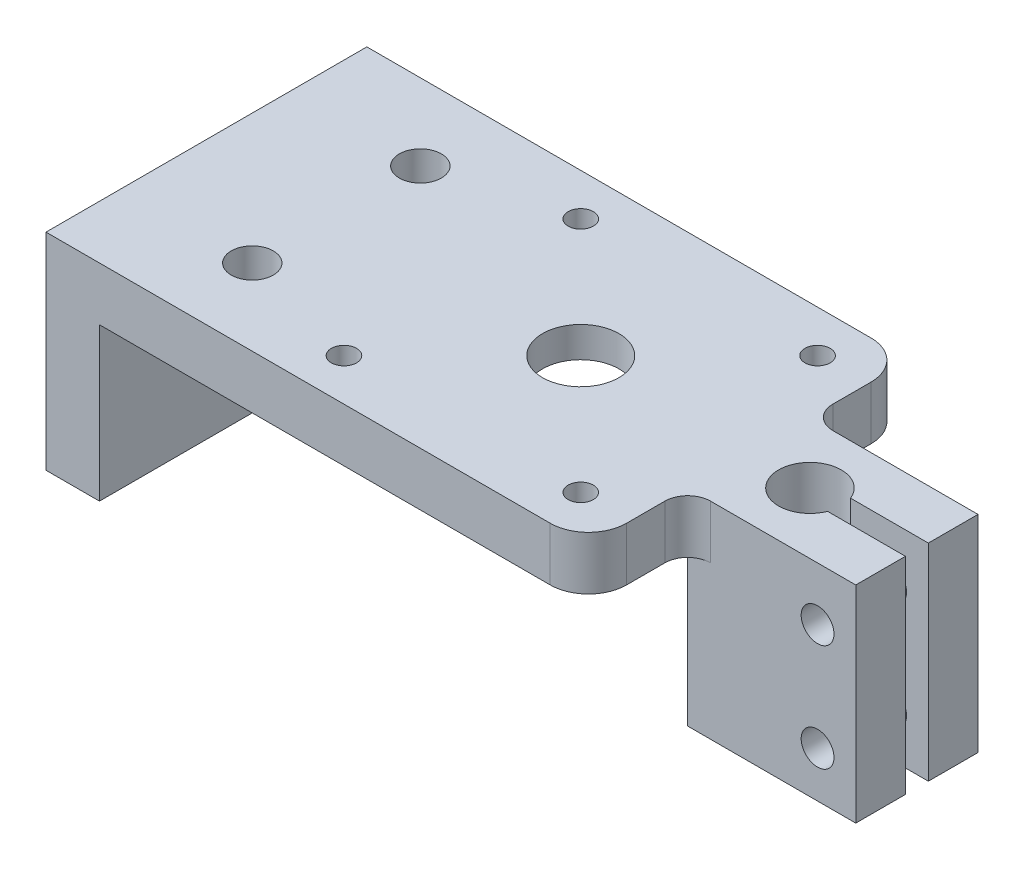
ISO-10303-21;
HEADER;
FILE_DESCRIPTION(('STEP AP214'),'2;1');
FILE_NAME('part.step','',(''),(''),'','','');
FILE_SCHEMA(('AUTOMOTIVE_DESIGN { 1 0 10303 214 1 1 1 1 }'));
ENDSEC;
DATA;
#1=APPLICATION_CONTEXT('core data for automotive mechanical design processes');
#2=APPLICATION_PROTOCOL_DEFINITION('international standard','automotive_design',2000,#1);
#3=PRODUCT_CONTEXT('',#1,'mechanical');
#4=PRODUCT('Part','Part','',(#3));
#5=PRODUCT_RELATED_PRODUCT_CATEGORY('part','',(#4));
#6=PRODUCT_DEFINITION_FORMATION('','',#4);
#7=PRODUCT_DEFINITION_CONTEXT('part definition',#1,'design');
#8=PRODUCT_DEFINITION('design','',#6,#7);
#9=PRODUCT_DEFINITION_SHAPE('','',#8);
#10=(LENGTH_UNIT() NAMED_UNIT(*) SI_UNIT(.MILLI.,.METRE.));
#11=(NAMED_UNIT(*) PLANE_ANGLE_UNIT() SI_UNIT($,.RADIAN.));
#12=(NAMED_UNIT(*) SI_UNIT($,.STERADIAN.) SOLID_ANGLE_UNIT());
#13=UNCERTAINTY_MEASURE_WITH_UNIT(LENGTH_MEASURE(1.E-05),#10,'distance_accuracy_value','');
#14=(GEOMETRIC_REPRESENTATION_CONTEXT(3) GLOBAL_UNCERTAINTY_ASSIGNED_CONTEXT((#13)) GLOBAL_UNIT_ASSIGNED_CONTEXT((#10,
#11,#12)) REPRESENTATION_CONTEXT('',''));
#15=CARTESIAN_POINT('',(0.,0.,0.));
#16=DIRECTION('',(0.,0.,1.));
#17=DIRECTION('',(1.,0.,0.));
#18=AXIS2_PLACEMENT_3D('',#15,#16,#17);
#19=CARTESIAN_POINT('',(54.,-20.,7.99999999999999));
#20=DIRECTION('',(1.,0.,0.));
#21=DIRECTION('',(0.,0.,-1.));
#22=AXIS2_PLACEMENT_3D('',#19,#20,#21);
#23=PLANE('',#22);
#24=DIRECTION('',(0.,1.,0.));
#25=VECTOR('',#24,1.);
#26=CARTESIAN_POINT('',(54.,-20.,1.49999999999999));
#27=LINE('',#26,#25);
#28=CARTESIAN_POINT('',(54.,-20.,1.49999999999999));
#29=VERTEX_POINT('',#28);
#30=CARTESIAN_POINT('',(54.,7.,1.49999999999999));
#31=VERTEX_POINT('',#30);
#32=EDGE_CURVE('E195',#29,#31,#27,.T.);
#33=ORIENTED_EDGE('',*,*,#32,.T.);
#34=DIRECTION('',(0.,0.,-1.));
#35=VECTOR('',#34,1.);
#36=CARTESIAN_POINT('',(54.,7.,7.99999999999999));
#37=LINE('',#36,#35);
#38=CARTESIAN_POINT('',(54.,7.,7.99999999999999));
#39=VERTEX_POINT('',#38);
#40=EDGE_CURVE('E346',#39,#31,#37,.T.);
#41=ORIENTED_EDGE('',*,*,#40,.F.);
#42=DIRECTION('',(0.,1.,0.));
#43=VECTOR('',#42,1.);
#44=CARTESIAN_POINT('',(54.,-20.,7.99999999999999));
#45=LINE('',#44,#43);
#46=CARTESIAN_POINT('',(54.,-20.,7.99999999999999));
#47=VERTEX_POINT('',#46);
#48=EDGE_CURVE('E215',#47,#39,#45,.T.);
#49=ORIENTED_EDGE('',*,*,#48,.F.);
#50=DIRECTION('',(0.,0.,-1.));
#51=VECTOR('',#50,1.);
#52=CARTESIAN_POINT('',(54.,-20.,7.99999999999999));
#53=LINE('',#52,#51);
#54=EDGE_CURVE('E202',#47,#29,#53,.T.);
#55=ORIENTED_EDGE('',*,*,#54,.T.);
#56=EDGE_LOOP('',(#33,#41,#49,#55));
#57=FACE_BOUND('',#56,.T.);
#58=ADVANCED_FACE('F39',(#57),#23,.T.);
#59=CARTESIAN_POINT('',(49.,-14.,14.0000000000001));
#60=DIRECTION('',(0.,0.,-1.));
#61=DIRECTION('',(-1.,0.,0.));
#62=AXIS2_PLACEMENT_3D('',#59,#60,#61);
#63=CYLINDRICAL_SURFACE('',#62,2.15);
#64=CARTESIAN_POINT('',(49.,-14.,1.5));
#65=DIRECTION('',(0.,0.,1.));
#66=DIRECTION('',(1.,0.,0.));
#67=AXIS2_PLACEMENT_3D('',#64,#65,#66);
#68=CIRCLE('',#67,2.15);
#69=CARTESIAN_POINT('',(51.15,-14.,1.5));
#70=VERTEX_POINT('',#69);
#71=EDGE_CURVE('E284',#70,#70,#68,.F.);
#72=ORIENTED_EDGE('',*,*,#71,.T.);
#73=EDGE_LOOP('',(#72));
#74=FACE_BOUND('',#73,.T.);
#75=CARTESIAN_POINT('',(49.,-14.,7.99999999999999));
#76=DIRECTION('',(0.,0.,1.));
#77=DIRECTION('',(1.,0.,0.));
#78=AXIS2_PLACEMENT_3D('',#75,#76,#77);
#79=CIRCLE('',#78,2.15);
#80=CARTESIAN_POINT('',(51.15,-14.,7.99999999999999));
#81=VERTEX_POINT('',#80);
#82=EDGE_CURVE('E435',#81,#81,#79,.T.);
#83=ORIENTED_EDGE('',*,*,#82,.T.);
#84=EDGE_LOOP('',(#83));
#85=FACE_BOUND('',#84,.T.);
#86=ADVANCED_FACE('F473',(#74,#85),#63,.F.);
#87=CARTESIAN_POINT('',(49.,0.,14.0000000000001));
#88=DIRECTION('',(0.,0.,-1.));
#89=DIRECTION('',(-1.,0.,0.));
#90=AXIS2_PLACEMENT_3D('',#87,#88,#89);
#91=CYLINDRICAL_SURFACE('',#90,2.15);
#92=CARTESIAN_POINT('',(49.,0.,1.5));
#93=DIRECTION('',(0.,0.,1.));
#94=DIRECTION('',(1.,0.,0.));
#95=AXIS2_PLACEMENT_3D('',#92,#93,#94);
#96=CIRCLE('',#95,2.15);
#97=CARTESIAN_POINT('',(51.15,0.,1.5));
#98=VERTEX_POINT('',#97);
#99=EDGE_CURVE('E281',#98,#98,#96,.F.);
#100=ORIENTED_EDGE('',*,*,#99,.T.);
#101=EDGE_LOOP('',(#100));
#102=FACE_BOUND('',#101,.T.);
#103=CARTESIAN_POINT('',(49.,0.,7.99999999999999));
#104=DIRECTION('',(0.,0.,1.));
#105=DIRECTION('',(1.,0.,0.));
#106=AXIS2_PLACEMENT_3D('',#103,#104,#105);
#107=CIRCLE('',#106,2.15);
#108=CARTESIAN_POINT('',(51.15,0.,7.99999999999999));
#109=VERTEX_POINT('',#108);
#110=EDGE_CURVE('E432',#109,#109,#107,.T.);
#111=ORIENTED_EDGE('',*,*,#110,.T.);
#112=EDGE_LOOP('',(#111));
#113=FACE_BOUND('',#112,.T.);
#114=ADVANCED_FACE('F470',(#102,#113),#91,.F.);
#115=CARTESIAN_POINT('',(32.,7.,21.));
#116=DIRECTION('',(-1.,0.,0.));
#117=DIRECTION('',(0.,0.,1.));
#118=AXIS2_PLACEMENT_3D('',#115,#116,#117);
#119=PLANE('',#118);
#120=DIRECTION('',(0.,0.,-1.));
#121=VECTOR('',#120,1.);
#122=CARTESIAN_POINT('',(32.,0.,21.));
#123=LINE('',#122,#121);
#124=CARTESIAN_POINT('',(32.,0.,-11.));
#125=VERTEX_POINT('',#124);
#126=CARTESIAN_POINT('',(32.,0.,-16.));
#127=VERTEX_POINT('',#126);
#128=EDGE_CURVE('E242',#125,#127,#123,.T.);
#129=ORIENTED_EDGE('',*,*,#128,.T.);
#130=DIRECTION('',(0.,-1.,0.));
#131=VECTOR('',#130,1.);
#132=CARTESIAN_POINT('',(32.,7.,-16.));
#133=LINE('',#132,#131);
#134=CARTESIAN_POINT('',(32.,7.,-16.));
#135=VERTEX_POINT('',#134);
#136=EDGE_CURVE('E316',#127,#135,#133,.F.);
#137=ORIENTED_EDGE('',*,*,#136,.T.);
#138=DIRECTION('',(0.,0.,-1.));
#139=VECTOR('',#138,1.);
#140=CARTESIAN_POINT('',(32.,7.,21.));
#141=LINE('',#140,#139);
#142=CARTESIAN_POINT('',(32.,7.,-11.));
#143=VERTEX_POINT('',#142);
#144=EDGE_CURVE('E230',#143,#135,#141,.T.);
#145=ORIENTED_EDGE('',*,*,#144,.F.);
#146=DIRECTION('',(0.,1.,0.));
#147=VECTOR('',#146,1.);
#148=CARTESIAN_POINT('',(32.,7.,-11.));
#149=LINE('',#148,#147);
#150=EDGE_CURVE('E298',#143,#125,#149,.F.);
#151=ORIENTED_EDGE('',*,*,#150,.T.);
#152=EDGE_LOOP('',(#129,#137,#145,#151));
#153=FACE_BOUND('',#152,.T.);
#154=ADVANCED_FACE('F365',(#153),#119,.F.);
#155=CARTESIAN_POINT('',(-32.,7.,21.));
#156=DIRECTION('',(0.,0.,-1.));
#157=DIRECTION('',(-1.,0.,0.));
#158=AXIS2_PLACEMENT_3D('',#155,#156,#157);
#159=PLANE('',#158);
#160=DIRECTION('',(1.,0.,0.));
#161=VECTOR('',#160,1.);
#162=CARTESIAN_POINT('',(-32.,0.,21.));
#163=LINE('',#162,#161);
#164=CARTESIAN_POINT('',(-32.,0.,21.));
#165=VERTEX_POINT('',#164);
#166=CARTESIAN_POINT('',(27.,0.,21.));
#167=VERTEX_POINT('',#166);
#168=EDGE_CURVE('E231',#165,#167,#163,.T.);
#169=ORIENTED_EDGE('',*,*,#168,.T.);
#170=DIRECTION('',(0.,-1.,0.));
#171=VECTOR('',#170,1.);
#172=CARTESIAN_POINT('',(27.,7.,21.));
#173=LINE('',#172,#171);
#174=CARTESIAN_POINT('',(27.,7.,21.));
#175=VERTEX_POINT('',#174);
#176=EDGE_CURVE('E11',#167,#175,#173,.F.);
#177=ORIENTED_EDGE('',*,*,#176,.T.);
#178=DIRECTION('',(1.,0.,0.));
#179=VECTOR('',#178,1.);
#180=CARTESIAN_POINT('',(-32.,7.,21.));
#181=LINE('',#180,#179);
#182=CARTESIAN_POINT('',(-39.,7.,21.));
#183=VERTEX_POINT('',#182);
#184=EDGE_CURVE('E234',#183,#175,#181,.T.);
#185=ORIENTED_EDGE('',*,*,#184,.F.);
#186=DIRECTION('',(0.,1.,0.));
#187=VECTOR('',#186,1.);
#188=CARTESIAN_POINT('',(-39.,7.,21.));
#189=LINE('',#188,#187);
#190=CARTESIAN_POINT('',(-39.,-20.,21.));
#191=VERTEX_POINT('',#190);
#192=EDGE_CURVE('E421',#191,#183,#189,.T.);
#193=ORIENTED_EDGE('',*,*,#192,.F.);
#194=DIRECTION('',(1.,0.,0.));
#195=VECTOR('',#194,1.);
#196=CARTESIAN_POINT('',(-39.,-20.,21.));
#197=LINE('',#196,#195);
#198=CARTESIAN_POINT('',(-32.,-20.,21.));
#199=VERTEX_POINT('',#198);
#200=EDGE_CURVE('E407',#191,#199,#197,.T.);
#201=ORIENTED_EDGE('',*,*,#200,.T.);
#202=DIRECTION('',(0.,1.,0.));
#203=VECTOR('',#202,1.);
#204=CARTESIAN_POINT('',(-32.,7.,21.));
#205=LINE('',#204,#203);
#206=EDGE_CURVE('E411',#199,#165,#205,.T.);
#207=ORIENTED_EDGE('',*,*,#206,.T.);
#208=EDGE_LOOP('',(#169,#177,#185,#193,#201,#207));
#209=FACE_BOUND('',#208,.T.);
#210=ADVANCED_FACE('F615',(#209),#159,.F.);
#211=CARTESIAN_POINT('',(32.,7.,16.));
#212=VERTEX_POINT('',#211);
#213=CARTESIAN_POINT('',(32.,7.,11.));
#214=VERTEX_POINT('',#213);
#215=EDGE_CURVE('E232',#212,#214,#141,.T.);
#216=ORIENTED_EDGE('',*,*,#215,.F.);
#217=DIRECTION('',(0.,-1.,0.));
#218=VECTOR('',#217,1.);
#219=CARTESIAN_POINT('',(32.,7.,16.));
#220=LINE('',#219,#218);
#221=CARTESIAN_POINT('',(32.,0.,16.));
#222=VERTEX_POINT('',#221);
#223=EDGE_CURVE('E47',#212,#222,#220,.T.);
#224=ORIENTED_EDGE('',*,*,#223,.T.);
#225=CARTESIAN_POINT('',(32.,0.,11.));
#226=VERTEX_POINT('',#225);
#227=EDGE_CURVE('E243',#222,#226,#123,.T.);
#228=ORIENTED_EDGE('',*,*,#227,.T.);
#229=DIRECTION('',(0.,1.,0.));
#230=VECTOR('',#229,1.);
#231=CARTESIAN_POINT('',(32.,7.,11.));
#232=LINE('',#231,#230);
#233=EDGE_CURVE('E236',#226,#214,#232,.T.);
#234=ORIENTED_EDGE('',*,*,#233,.T.);
#235=EDGE_LOOP('',(#216,#224,#228,#234));
#236=FACE_BOUND('',#235,.T.);
#237=ADVANCED_FACE('F324',(#236),#119,.F.);
#238=CARTESIAN_POINT('',(-32.,7.,-21.));
#239=DIRECTION('',(0.,0.,-1.));
#240=DIRECTION('',(-1.,0.,0.));
#241=AXIS2_PLACEMENT_3D('',#238,#239,#240);
#242=PLANE('',#241);
#243=DIRECTION('',(1.,0.,0.));
#244=VECTOR('',#243,1.);
#245=CARTESIAN_POINT('',(-32.,7.,-21.));
#246=LINE('',#245,#244);
#247=CARTESIAN_POINT('',(-39.,7.,-21.));
#248=VERTEX_POINT('',#247);
#249=CARTESIAN_POINT('',(27.,7.,-21.));
#250=VERTEX_POINT('',#249);
#251=EDGE_CURVE('E227',#248,#250,#246,.T.);
#252=ORIENTED_EDGE('',*,*,#251,.T.);
#253=DIRECTION('',(0.,-1.,0.));
#254=VECTOR('',#253,1.);
#255=CARTESIAN_POINT('',(27.,0.,-21.));
#256=LINE('',#255,#254);
#257=CARTESIAN_POINT('',(27.,0.,-21.));
#258=VERTEX_POINT('',#257);
#259=EDGE_CURVE('E309',#250,#258,#256,.T.);
#260=ORIENTED_EDGE('',*,*,#259,.T.);
#261=DIRECTION('',(1.,0.,0.));
#262=VECTOR('',#261,1.);
#263=CARTESIAN_POINT('',(-32.,0.,-21.));
#264=LINE('',#263,#262);
#265=CARTESIAN_POINT('',(-32.,0.,-21.));
#266=VERTEX_POINT('',#265);
#267=EDGE_CURVE('E239',#266,#258,#264,.T.);
#268=ORIENTED_EDGE('',*,*,#267,.F.);
#269=DIRECTION('',(0.,-1.,0.));
#270=VECTOR('',#269,1.);
#271=CARTESIAN_POINT('',(-32.,7.,-21.));
#272=LINE('',#271,#270);
#273=CARTESIAN_POINT('',(-32.,-20.,-21.));
#274=VERTEX_POINT('',#273);
#275=EDGE_CURVE('E417',#266,#274,#272,.T.);
#276=ORIENTED_EDGE('',*,*,#275,.T.);
#277=DIRECTION('',(1.,0.,0.));
#278=VECTOR('',#277,1.);
#279=CARTESIAN_POINT('',(-39.,-20.,-21.));
#280=LINE('',#279,#278);
#281=CARTESIAN_POINT('',(-39.,-20.,-21.));
#282=VERTEX_POINT('',#281);
#283=EDGE_CURVE('E400',#282,#274,#280,.T.);
#284=ORIENTED_EDGE('',*,*,#283,.F.);
#285=DIRECTION('',(0.,-1.,0.));
#286=VECTOR('',#285,1.);
#287=CARTESIAN_POINT('',(-39.,7.,-21.));
#288=LINE('',#287,#286);
#289=EDGE_CURVE('E414',#248,#282,#288,.T.);
#290=ORIENTED_EDGE('',*,*,#289,.F.);
#291=EDGE_LOOP('',(#252,#260,#268,#276,#284,#290));
#292=FACE_BOUND('',#291,.T.);
#293=ADVANCED_FACE('F637',(#292),#242,.T.);
#294=CARTESIAN_POINT('',(0.,7.,0.));
#295=DIRECTION('',(0.,-1.,0.));
#296=DIRECTION('',(0.,0.,-1.));
#297=AXIS2_PLACEMENT_3D('',#294,#295,#296);
#298=PLANE('',#297);
#299=CARTESIAN_POINT('',(9.99999999999993,7.,0.));
#300=DIRECTION('',(0.,1.,0.));
#301=DIRECTION('',(0.,0.,1.));
#302=AXIS2_PLACEMENT_3D('',#299,#300,#301);
#303=CIRCLE('',#302,5.00000000000008);
#304=CARTESIAN_POINT('',(9.99999999999993,7.,5.00000000000014));
#305=VERTEX_POINT('',#304);
#306=EDGE_CURVE('E276',#305,#305,#303,.T.);
#307=ORIENTED_EDGE('',*,*,#306,.F.);
#308=EDGE_LOOP('',(#307));
#309=FACE_BOUND('',#308,.T.);
#310=CARTESIAN_POINT('',(-5.50000000000007,7.,15.5000000000001));
#311=DIRECTION('',(0.,1.,0.));
#312=DIRECTION('',(0.,0.,1.));
#313=AXIS2_PLACEMENT_3D('',#310,#311,#312);
#314=CIRCLE('',#313,1.65000000000008);
#315=CARTESIAN_POINT('',(-5.50000000000007,7.,17.1500000000001));
#316=VERTEX_POINT('',#315);
#317=EDGE_CURVE('E396',#316,#316,#314,.T.);
#318=ORIENTED_EDGE('',*,*,#317,.F.);
#319=EDGE_LOOP('',(#318));
#320=FACE_BOUND('',#319,.T.);
#321=CARTESIAN_POINT('',(25.4999999999999,7.,15.4999999999998));
#322=DIRECTION('',(0.,1.,0.));
#323=DIRECTION('',(0.,0.,1.));
#324=AXIS2_PLACEMENT_3D('',#321,#322,#323);
#325=CIRCLE('',#324,1.65);
#326=CARTESIAN_POINT('',(25.4999999999999,7.,17.1499999999998));
#327=VERTEX_POINT('',#326);
#328=EDGE_CURVE('E399',#327,#327,#325,.T.);
#329=ORIENTED_EDGE('',*,*,#328,.F.);
#330=EDGE_LOOP('',(#329));
#331=FACE_BOUND('',#330,.T.);
#332=CARTESIAN_POINT('',(25.4999999999999,7.,-15.5000000000002));
#333=DIRECTION('',(0.,1.,0.));
#334=DIRECTION('',(0.,0.,1.));
#335=AXIS2_PLACEMENT_3D('',#332,#333,#334);
#336=CIRCLE('',#335,1.65);
#337=CARTESIAN_POINT('',(25.4999999999999,7.,-13.8500000000002));
#338=VERTEX_POINT('',#337);
#339=EDGE_CURVE('E395',#338,#338,#336,.T.);
#340=ORIENTED_EDGE('',*,*,#339,.F.);
#341=EDGE_LOOP('',(#340));
#342=FACE_BOUND('',#341,.T.);
#343=CARTESIAN_POINT('',(-5.50000000000008,7.,-15.4999999999999));
#344=DIRECTION('',(0.,1.,0.));
#345=DIRECTION('',(0.,0.,1.));
#346=AXIS2_PLACEMENT_3D('',#343,#344,#345);
#347=CIRCLE('',#346,1.65000000000008);
#348=CARTESIAN_POINT('',(-5.50000000000008,7.,-13.8499999999999));
#349=VERTEX_POINT('',#348);
#350=EDGE_CURVE('E259',#349,#349,#347,.T.);
#351=ORIENTED_EDGE('',*,*,#350,.F.);
#352=EDGE_LOOP('',(#351));
#353=FACE_BOUND('',#352,.T.);
#354=CARTESIAN_POINT('',(-22.,7.,-11.));
#355=DIRECTION('',(0.,1.,0.));
#356=DIRECTION('',(0.,0.,1.));
#357=AXIS2_PLACEMENT_3D('',#354,#355,#356);
#358=CIRCLE('',#357,2.75);
#359=CARTESIAN_POINT('',(-22.,7.,-8.25));
#360=VERTEX_POINT('',#359);
#361=EDGE_CURVE('E251',#360,#360,#358,.T.);
#362=ORIENTED_EDGE('',*,*,#361,.F.);
#363=EDGE_LOOP('',(#362));
#364=FACE_BOUND('',#363,.T.);
#365=CARTESIAN_POINT('',(-22.,7.,11.));
#366=DIRECTION('',(0.,1.,0.));
#367=DIRECTION('',(0.,0.,1.));
#368=AXIS2_PLACEMENT_3D('',#365,#366,#367);
#369=CIRCLE('',#368,2.75);
#370=CARTESIAN_POINT('',(-22.,7.,13.75));
#371=VERTEX_POINT('',#370);
#372=EDGE_CURVE('E268',#371,#371,#369,.T.);
#373=ORIENTED_EDGE('',*,*,#372,.F.);
#374=EDGE_LOOP('',(#373));
#375=FACE_BOUND('',#374,.T.);
#376=ORIENTED_EDGE('',*,*,#144,.T.);
#377=CARTESIAN_POINT('',(27.,7.,-16.));
#378=DIRECTION('',(0.,-1.,0.));
#379=DIRECTION('',(0.,0.,-1.));
#380=AXIS2_PLACEMENT_3D('',#377,#378,#379);
#381=CIRCLE('',#380,5.);
#382=EDGE_CURVE('E319',#135,#250,#381,.F.);
#383=ORIENTED_EDGE('',*,*,#382,.T.);
#384=ORIENTED_EDGE('',*,*,#251,.F.);
#385=DIRECTION('',(0.,0.,-1.));
#386=VECTOR('',#385,1.);
#387=CARTESIAN_POINT('',(-39.,7.,-21.));
#388=LINE('',#387,#386);
#389=EDGE_CURVE('E410',#183,#248,#388,.T.);
#390=ORIENTED_EDGE('',*,*,#389,.F.);
#391=ORIENTED_EDGE('',*,*,#184,.T.);
#392=CARTESIAN_POINT('',(27.,7.,16.));
#393=DIRECTION('',(0.,-1.,0.));
#394=DIRECTION('',(0.,0.,-1.));
#395=AXIS2_PLACEMENT_3D('',#392,#393,#394);
#396=CIRCLE('',#395,5.);
#397=EDGE_CURVE('E54',#175,#212,#396,.F.);
#398=ORIENTED_EDGE('',*,*,#397,.T.);
#399=ORIENTED_EDGE('',*,*,#215,.T.);
#400=CARTESIAN_POINT('',(35.,7.,11.));
#401=DIRECTION('',(0.,-1.,0.));
#402=DIRECTION('',(0.,0.,-1.));
#403=AXIS2_PLACEMENT_3D('',#400,#401,#402);
#404=CIRCLE('',#403,3.);
#405=CARTESIAN_POINT('',(35.,7.,7.99999999999999));
#406=VERTEX_POINT('',#405);
#407=EDGE_CURVE('E300',#214,#406,#404,.T.);
#408=ORIENTED_EDGE('',*,*,#407,.T.);
#409=DIRECTION('',(1.,0.,0.));
#410=VECTOR('',#409,1.);
#411=CARTESIAN_POINT('',(32.,7.,7.99999999999999));
#412=LINE('',#411,#410);
#413=EDGE_CURVE('E340',#406,#39,#412,.T.);
#414=ORIENTED_EDGE('',*,*,#413,.T.);
#415=ORIENTED_EDGE('',*,*,#40,.T.);
#416=DIRECTION('',(1.,0.,0.));
#417=VECTOR('',#416,1.);
#418=CARTESIAN_POINT('',(40.,7.,1.50000000000001));
#419=LINE('',#418,#417);
#420=CARTESIAN_POINT('',(43.8157568056678,7.,1.5));
#421=VERTEX_POINT('',#420);
#422=EDGE_CURVE('E186',#421,#31,#419,.T.);
#423=ORIENTED_EDGE('',*,*,#422,.F.);
#424=CARTESIAN_POINT('',(40.,7.,0.));
#425=DIRECTION('',(0.,1.,0.));
#426=DIRECTION('',(0.,0.,1.));
#427=AXIS2_PLACEMENT_3D('',#424,#425,#426);
#428=CIRCLE('',#427,4.1);
#429=CARTESIAN_POINT('',(43.8157568056678,7.,-1.49999999999999));
#430=VERTEX_POINT('',#429);
#431=EDGE_CURVE('E254',#430,#421,#428,.T.);
#432=ORIENTED_EDGE('',*,*,#431,.F.);
#433=DIRECTION('',(-1.,0.,0.));
#434=VECTOR('',#433,1.);
#435=CARTESIAN_POINT('',(40.,7.,-1.49999999999999));
#436=LINE('',#435,#434);
#437=CARTESIAN_POINT('',(54.,7.,-1.49999999999999));
#438=VERTEX_POINT('',#437);
#439=EDGE_CURVE('E379',#438,#430,#436,.T.);
#440=ORIENTED_EDGE('',*,*,#439,.F.);
#441=CARTESIAN_POINT('',(54.,7.,-8.00000000000001));
#442=VERTEX_POINT('',#441);
#443=EDGE_CURVE('E194',#438,#442,#37,.T.);
#444=ORIENTED_EDGE('',*,*,#443,.T.);
#445=DIRECTION('',(-1.,0.,0.));
#446=VECTOR('',#445,1.);
#447=CARTESIAN_POINT('',(32.,7.,-7.99999999999999));
#448=LINE('',#447,#446);
#449=CARTESIAN_POINT('',(35.,7.,-7.99999999999999));
#450=VERTEX_POINT('',#449);
#451=EDGE_CURVE('E207',#442,#450,#448,.T.);
#452=ORIENTED_EDGE('',*,*,#451,.T.);
#453=CARTESIAN_POINT('',(35.,7.,-11.));
#454=DIRECTION('',(0.,-1.,0.));
#455=DIRECTION('',(0.,0.,-1.));
#456=AXIS2_PLACEMENT_3D('',#453,#454,#455);
#457=CIRCLE('',#456,3.);
#458=EDGE_CURVE('E305',#450,#143,#457,.T.);
#459=ORIENTED_EDGE('',*,*,#458,.T.);
#460=EDGE_LOOP('',(#376,#383,#384,#390,#391,#398,#399,#408,#414,#415,#423,#432,#440,#444,#452,#459));
#461=FACE_BOUND('',#460,.T.);
#462=ADVANCED_FACE('F338',(#309,#320,#331,#342,#353,#364,#375,#461),#298,.F.);
#463=CARTESIAN_POINT('',(0.,0.,0.));
#464=DIRECTION('',(0.,-1.,0.));
#465=DIRECTION('',(0.,0.,-1.));
#466=AXIS2_PLACEMENT_3D('',#463,#464,#465);
#467=PLANE('',#466);
#468=CARTESIAN_POINT('',(-5.50000000000007,0.,15.5000000000001));
#469=DIRECTION('',(0.,-1.,0.));
#470=DIRECTION('',(0.,0.,-1.));
#471=AXIS2_PLACEMENT_3D('',#468,#469,#470);
#472=CIRCLE('',#471,1.65000000000008);
#473=CARTESIAN_POINT('',(-5.50000000000007,0.,13.85));
#474=VERTEX_POINT('',#473);
#475=EDGE_CURVE('E265',#474,#474,#472,.T.);
#476=ORIENTED_EDGE('',*,*,#475,.F.);
#477=EDGE_LOOP('',(#476));
#478=FACE_BOUND('',#477,.T.);
#479=CARTESIAN_POINT('',(25.4999999999999,0.,15.4999999999998));
#480=DIRECTION('',(0.,-1.,0.));
#481=DIRECTION('',(0.,0.,-1.));
#482=AXIS2_PLACEMENT_3D('',#479,#480,#481);
#483=CIRCLE('',#482,1.65);
#484=CARTESIAN_POINT('',(25.4999999999999,0.,13.8499999999998));
#485=VERTEX_POINT('',#484);
#486=EDGE_CURVE('E262',#485,#485,#483,.T.);
#487=ORIENTED_EDGE('',*,*,#486,.F.);
#488=EDGE_LOOP('',(#487));
#489=FACE_BOUND('',#488,.T.);
#490=CARTESIAN_POINT('',(25.4999999999999,0.,-15.5000000000002));
#491=DIRECTION('',(0.,-1.,0.));
#492=DIRECTION('',(0.,0.,-1.));
#493=AXIS2_PLACEMENT_3D('',#490,#491,#492);
#494=CIRCLE('',#493,1.65);
#495=CARTESIAN_POINT('',(25.4999999999999,0.,-17.1500000000002));
#496=VERTEX_POINT('',#495);
#497=EDGE_CURVE('E258',#496,#496,#494,.T.);
#498=ORIENTED_EDGE('',*,*,#497,.F.);
#499=EDGE_LOOP('',(#498));
#500=FACE_BOUND('',#499,.T.);
#501=CARTESIAN_POINT('',(-5.50000000000008,0.,-15.4999999999999));
#502=DIRECTION('',(0.,-1.,0.));
#503=DIRECTION('',(0.,0.,-1.));
#504=AXIS2_PLACEMENT_3D('',#501,#502,#503);
#505=CIRCLE('',#504,1.65000000000008);
#506=CARTESIAN_POINT('',(-5.50000000000008,0.,-17.15));
#507=VERTEX_POINT('',#506);
#508=EDGE_CURVE('E255',#507,#507,#505,.T.);
#509=ORIENTED_EDGE('',*,*,#508,.F.);
#510=EDGE_LOOP('',(#509));
#511=FACE_BOUND('',#510,.T.);
#512=CARTESIAN_POINT('',(-22.,0.,-11.));
#513=DIRECTION('',(0.,-1.,0.));
#514=DIRECTION('',(0.,0.,-1.));
#515=AXIS2_PLACEMENT_3D('',#512,#513,#514);
#516=CIRCLE('',#515,2.75);
#517=CARTESIAN_POINT('',(-22.,0.,-13.75));
#518=VERTEX_POINT('',#517);
#519=EDGE_CURVE('E250',#518,#518,#516,.T.);
#520=ORIENTED_EDGE('',*,*,#519,.F.);
#521=EDGE_LOOP('',(#520));
#522=FACE_BOUND('',#521,.T.);
#523=CARTESIAN_POINT('',(-22.,0.,11.));
#524=DIRECTION('',(0.,-1.,0.));
#525=DIRECTION('',(0.,0.,-1.));
#526=AXIS2_PLACEMENT_3D('',#523,#524,#525);
#527=CIRCLE('',#526,2.75);
#528=CARTESIAN_POINT('',(-22.,0.,8.25));
#529=VERTEX_POINT('',#528);
#530=EDGE_CURVE('E247',#529,#529,#527,.T.);
#531=ORIENTED_EDGE('',*,*,#530,.F.);
#532=EDGE_LOOP('',(#531));
#533=FACE_BOUND('',#532,.T.);
#534=CARTESIAN_POINT('',(9.99999999999993,0.,0.));
#535=DIRECTION('',(0.,1.,0.));
#536=DIRECTION('',(0.,0.,1.));
#537=AXIS2_PLACEMENT_3D('',#534,#535,#536);
#538=CIRCLE('',#537,12.0000000000001);
#539=CARTESIAN_POINT('',(9.99999999999993,0.,12.0000000000001));
#540=VERTEX_POINT('',#539);
#541=EDGE_CURVE('E349',#540,#540,#538,.T.);
#542=ORIENTED_EDGE('',*,*,#541,.T.);
#543=EDGE_LOOP('',(#542));
#544=FACE_BOUND('',#543,.T.);
#545=ORIENTED_EDGE('',*,*,#267,.T.);
#546=CARTESIAN_POINT('',(27.,0.,-16.));
#547=DIRECTION('',(0.,-1.,0.));
#548=DIRECTION('',(0.,0.,-1.));
#549=AXIS2_PLACEMENT_3D('',#546,#547,#548);
#550=CIRCLE('',#549,5.);
#551=EDGE_CURVE('E314',#258,#127,#550,.T.);
#552=ORIENTED_EDGE('',*,*,#551,.T.);
#553=ORIENTED_EDGE('',*,*,#128,.F.);
#554=CARTESIAN_POINT('',(35.,0.,-11.));
#555=DIRECTION('',(0.,-1.,0.));
#556=DIRECTION('',(0.,0.,-1.));
#557=AXIS2_PLACEMENT_3D('',#554,#555,#556);
#558=CIRCLE('',#557,3.);
#559=CARTESIAN_POINT('',(35.,0.,-7.99999999999999));
#560=VERTEX_POINT('',#559);
#561=EDGE_CURVE('E307',#125,#560,#558,.F.);
#562=ORIENTED_EDGE('',*,*,#561,.T.);
#563=DIRECTION('',(1.,0.,0.));
#564=VECTOR('',#563,1.);
#565=CARTESIAN_POINT('',(0.,0.,-7.99999999999996));
#566=LINE('',#565,#564);
#567=CARTESIAN_POINT('',(32.,0.,-7.99999999999998));
#568=VERTEX_POINT('',#567);
#569=EDGE_CURVE('E292',#568,#560,#566,.T.);
#570=ORIENTED_EDGE('',*,*,#569,.F.);
#571=CARTESIAN_POINT('',(32.,0.,7.99999999999999));
#572=VERTEX_POINT('',#571);
#573=EDGE_CURVE('E245',#572,#568,#123,.T.);
#574=ORIENTED_EDGE('',*,*,#573,.F.);
#575=DIRECTION('',(-1.,0.,0.));
#576=VECTOR('',#575,1.);
#577=CARTESIAN_POINT('',(0.,0.,7.99999999999998));
#578=LINE('',#577,#576);
#579=CARTESIAN_POINT('',(35.,0.,7.99999999999999));
#580=VERTEX_POINT('',#579);
#581=EDGE_CURVE('E287',#580,#572,#578,.T.);
#582=ORIENTED_EDGE('',*,*,#581,.F.);
#583=CARTESIAN_POINT('',(35.,0.,11.));
#584=DIRECTION('',(0.,-1.,0.));
#585=DIRECTION('',(0.,0.,-1.));
#586=AXIS2_PLACEMENT_3D('',#583,#584,#585);
#587=CIRCLE('',#586,3.);
#588=EDGE_CURVE('E302',#580,#226,#587,.F.);
#589=ORIENTED_EDGE('',*,*,#588,.T.);
#590=ORIENTED_EDGE('',*,*,#227,.F.);
#591=CARTESIAN_POINT('',(27.,0.,16.));
#592=DIRECTION('',(0.,-1.,0.));
#593=DIRECTION('',(0.,0.,-1.));
#594=AXIS2_PLACEMENT_3D('',#591,#592,#593);
#595=CIRCLE('',#594,5.);
#596=EDGE_CURVE('E312',#222,#167,#595,.T.);
#597=ORIENTED_EDGE('',*,*,#596,.T.);
#598=ORIENTED_EDGE('',*,*,#168,.F.);
#599=DIRECTION('',(0.,0.,-1.));
#600=VECTOR('',#599,1.);
#601=CARTESIAN_POINT('',(-32.,0.,21.));
#602=LINE('',#601,#600);
#603=EDGE_CURVE('E219',#165,#266,#602,.T.);
#604=ORIENTED_EDGE('',*,*,#603,.T.);
#605=EDGE_LOOP('',(#545,#552,#553,#562,#570,#574,#582,#589,#590,#597,#598,#604));
#606=FACE_BOUND('',#605,.T.);
#607=ADVANCED_FACE('F327',(#478,#489,#500,#511,#522,#533,#544,#606),#467,.T.);
#608=CARTESIAN_POINT('',(32.,-20.,7.99999999999999));
#609=DIRECTION('',(0.,0.,1.));
#610=DIRECTION('',(1.,0.,0.));
#611=AXIS2_PLACEMENT_3D('',#608,#609,#610);
#612=PLANE('',#611);
#613=ORIENTED_EDGE('',*,*,#110,.F.);
#614=EDGE_LOOP('',(#613));
#615=FACE_BOUND('',#614,.T.);
#616=ORIENTED_EDGE('',*,*,#82,.F.);
#617=EDGE_LOOP('',(#616));
#618=FACE_BOUND('',#617,.T.);
#619=ORIENTED_EDGE('',*,*,#413,.F.);
#620=DIRECTION('',(0.,1.,0.));
#621=VECTOR('',#620,1.);
#622=CARTESIAN_POINT('',(35.,-20.,7.99999999999999));
#623=LINE('',#622,#621);
#624=EDGE_CURVE('E289',#406,#580,#623,.F.);
#625=ORIENTED_EDGE('',*,*,#624,.T.);
#626=ORIENTED_EDGE('',*,*,#581,.T.);
#627=DIRECTION('',(0.,1.,0.));
#628=VECTOR('',#627,1.);
#629=CARTESIAN_POINT('',(32.,-20.,7.99999999999999));
#630=LINE('',#629,#628);
#631=CARTESIAN_POINT('',(32.,-20.,7.99999999999999));
#632=VERTEX_POINT('',#631);
#633=EDGE_CURVE('E216',#632,#572,#630,.T.);
#634=ORIENTED_EDGE('',*,*,#633,.F.);
#635=DIRECTION('',(1.,0.,0.));
#636=VECTOR('',#635,1.);
#637=CARTESIAN_POINT('',(32.,-20.,7.99999999999999));
#638=LINE('',#637,#636);
#639=EDGE_CURVE('E203',#632,#47,#638,.T.);
#640=ORIENTED_EDGE('',*,*,#639,.T.);
#641=ORIENTED_EDGE('',*,*,#48,.T.);
#642=EDGE_LOOP('',(#619,#625,#626,#634,#640,#641));
#643=FACE_BOUND('',#642,.T.);
#644=ADVANCED_FACE('F342',(#615,#618,#643),#612,.T.);
#645=CARTESIAN_POINT('',(32.,-20.,7.99999999999999));
#646=DIRECTION('',(-1.,0.,0.));
#647=DIRECTION('',(0.,0.,1.));
#648=AXIS2_PLACEMENT_3D('',#645,#646,#647);
#649=PLANE('',#648);
#650=ORIENTED_EDGE('',*,*,#633,.T.);
#651=ORIENTED_EDGE('',*,*,#573,.T.);
#652=DIRECTION('',(0.,1.,0.));
#653=VECTOR('',#652,1.);
#654=CARTESIAN_POINT('',(32.,-20.,-7.99999999999999));
#655=LINE('',#654,#653);
#656=CARTESIAN_POINT('',(32.,-20.,-7.99999999999999));
#657=VERTEX_POINT('',#656);
#658=EDGE_CURVE('E220',#657,#568,#655,.T.);
#659=ORIENTED_EDGE('',*,*,#658,.F.);
#660=DIRECTION('',(0.,0.,1.));
#661=VECTOR('',#660,1.);
#662=CARTESIAN_POINT('',(32.,-20.,7.99999999999999));
#663=LINE('',#662,#661);
#664=EDGE_CURVE('E212',#657,#632,#663,.T.);
#665=ORIENTED_EDGE('',*,*,#664,.T.);
#666=EDGE_LOOP('',(#650,#651,#659,#665));
#667=FACE_BOUND('',#666,.T.);
#668=ADVANCED_FACE('F369',(#667),#649,.T.);
#669=CARTESIAN_POINT('',(32.,-20.,-7.99999999999999));
#670=DIRECTION('',(0.,0.,-1.));
#671=DIRECTION('',(-1.,0.,0.));
#672=AXIS2_PLACEMENT_3D('',#669,#670,#671);
#673=PLANE('',#672);
#674=CARTESIAN_POINT('',(49.,0.,-7.99999999999996));
#675=DIRECTION('',(0.,0.,-1.));
#676=DIRECTION('',(-1.,0.,0.));
#677=AXIS2_PLACEMENT_3D('',#674,#675,#676);
#678=CIRCLE('',#677,2.15);
#679=CARTESIAN_POINT('',(46.85,0.,-7.99999999999996));
#680=VERTEX_POINT('',#679);
#681=EDGE_CURVE('E438',#680,#680,#678,.T.);
#682=ORIENTED_EDGE('',*,*,#681,.F.);
#683=EDGE_LOOP('',(#682));
#684=FACE_BOUND('',#683,.T.);
#685=CARTESIAN_POINT('',(49.,-14.,-7.99999999999996));
#686=DIRECTION('',(0.,0.,-1.));
#687=DIRECTION('',(-1.,0.,0.));
#688=AXIS2_PLACEMENT_3D('',#685,#686,#687);
#689=CIRCLE('',#688,2.15);
#690=CARTESIAN_POINT('',(46.85,-14.,-7.99999999999996));
#691=VERTEX_POINT('',#690);
#692=EDGE_CURVE('E439',#691,#691,#689,.T.);
#693=ORIENTED_EDGE('',*,*,#692,.F.);
#694=EDGE_LOOP('',(#693));
#695=FACE_BOUND('',#694,.T.);
#696=ORIENTED_EDGE('',*,*,#569,.T.);
#697=DIRECTION('',(0.,1.,0.));
#698=VECTOR('',#697,1.);
#699=CARTESIAN_POINT('',(35.,-20.,-7.99999999999999));
#700=LINE('',#699,#698);
#701=EDGE_CURVE('E295',#560,#450,#700,.T.);
#702=ORIENTED_EDGE('',*,*,#701,.T.);
#703=ORIENTED_EDGE('',*,*,#451,.F.);
#704=DIRECTION('',(0.,1.,0.));
#705=VECTOR('',#704,1.);
#706=CARTESIAN_POINT('',(54.,-20.,-8.00000000000001));
#707=LINE('',#706,#705);
#708=CARTESIAN_POINT('',(54.,-20.,-8.00000000000001));
#709=VERTEX_POINT('',#708);
#710=EDGE_CURVE('E223',#709,#442,#707,.T.);
#711=ORIENTED_EDGE('',*,*,#710,.F.);
#712=DIRECTION('',(-1.,0.,0.));
#713=VECTOR('',#712,1.);
#714=CARTESIAN_POINT('',(32.,-20.,-7.99999999999999));
#715=LINE('',#714,#713);
#716=EDGE_CURVE('E201',#709,#657,#715,.T.);
#717=ORIENTED_EDGE('',*,*,#716,.T.);
#718=ORIENTED_EDGE('',*,*,#658,.T.);
#719=EDGE_LOOP('',(#696,#702,#703,#711,#717,#718));
#720=FACE_BOUND('',#719,.T.);
#721=ADVANCED_FACE('F356',(#684,#695,#720),#673,.T.);
#722=DIRECTION('',(0.,1.,0.));
#723=VECTOR('',#722,1.);
#724=CARTESIAN_POINT('',(54.,-20.,-1.49999999999999));
#725=LINE('',#724,#723);
#726=CARTESIAN_POINT('',(54.,-20.,-1.49999999999999));
#727=VERTEX_POINT('',#726);
#728=EDGE_CURVE('E177',#727,#438,#725,.T.);
#729=ORIENTED_EDGE('',*,*,#728,.F.);
#730=EDGE_CURVE('E192',#727,#709,#53,.T.);
#731=ORIENTED_EDGE('',*,*,#730,.T.);
#732=ORIENTED_EDGE('',*,*,#710,.T.);
#733=ORIENTED_EDGE('',*,*,#443,.F.);
#734=EDGE_LOOP('',(#729,#731,#732,#733));
#735=FACE_BOUND('',#734,.T.);
#736=ADVANCED_FACE('F190',(#735),#23,.T.);
#737=CARTESIAN_POINT('',(0.,-20.,0.));
#738=DIRECTION('',(0.,1.,0.));
#739=DIRECTION('',(0.,0.,1.));
#740=AXIS2_PLACEMENT_3D('',#737,#738,#739);
#741=PLANE('',#740);
#742=CARTESIAN_POINT('',(40.,-20.,0.));
#743=DIRECTION('',(0.,1.,0.));
#744=DIRECTION('',(0.,0.,1.));
#745=AXIS2_PLACEMENT_3D('',#742,#743,#744);
#746=CIRCLE('',#745,4.1);
#747=CARTESIAN_POINT('',(43.8157568056678,-20.,-1.49999999999999));
#748=VERTEX_POINT('',#747);
#749=CARTESIAN_POINT('',(43.8157568056678,-20.,1.5));
#750=VERTEX_POINT('',#749);
#751=EDGE_CURVE('E385',#748,#750,#746,.T.);
#752=ORIENTED_EDGE('',*,*,#751,.T.);
#753=DIRECTION('',(1.,0.,0.));
#754=VECTOR('',#753,1.);
#755=CARTESIAN_POINT('',(40.,-20.,1.50000000000001));
#756=LINE('',#755,#754);
#757=EDGE_CURVE('E185',#750,#29,#756,.T.);
#758=ORIENTED_EDGE('',*,*,#757,.T.);
#759=ORIENTED_EDGE('',*,*,#54,.F.);
#760=ORIENTED_EDGE('',*,*,#639,.F.);
#761=ORIENTED_EDGE('',*,*,#664,.F.);
#762=ORIENTED_EDGE('',*,*,#716,.F.);
#763=ORIENTED_EDGE('',*,*,#730,.F.);
#764=DIRECTION('',(-1.,0.,0.));
#765=VECTOR('',#764,1.);
#766=CARTESIAN_POINT('',(40.,-20.,-1.49999999999999));
#767=LINE('',#766,#765);
#768=EDGE_CURVE('E174',#727,#748,#767,.T.);
#769=ORIENTED_EDGE('',*,*,#768,.T.);
#770=EDGE_LOOP('',(#752,#758,#759,#760,#761,#762,#763,#769));
#771=FACE_BOUND('',#770,.T.);
#772=ADVANCED_FACE('F198',(#771),#741,.F.);
#773=CARTESIAN_POINT('',(9.99999999999993,3.,0.));
#774=DIRECTION('',(0.,-1.,0.));
#775=DIRECTION('',(0.,0.,-1.));
#776=AXIS2_PLACEMENT_3D('',#773,#774,#775);
#777=CYLINDRICAL_SURFACE('',#776,12.0000000000001);
#778=CARTESIAN_POINT('',(9.99999999999993,3.,0.));
#779=DIRECTION('',(0.,1.,0.));
#780=DIRECTION('',(0.,0.,1.));
#781=AXIS2_PLACEMENT_3D('',#778,#779,#780);
#782=CIRCLE('',#781,12.0000000000001);
#783=CARTESIAN_POINT('',(9.99999999999993,3.,12.0000000000001));
#784=VERTEX_POINT('',#783);
#785=EDGE_CURVE('E344',#784,#784,#782,.T.);
#786=ORIENTED_EDGE('',*,*,#785,.T.);
#787=EDGE_LOOP('',(#786));
#788=FACE_BOUND('',#787,.T.);
#789=ORIENTED_EDGE('',*,*,#541,.F.);
#790=EDGE_LOOP('',(#789));
#791=FACE_BOUND('',#790,.T.);
#792=ADVANCED_FACE('F487',(#788,#791),#777,.F.);
#793=CARTESIAN_POINT('',(9.99999999999993,3.,0.));
#794=DIRECTION('',(0.,1.,0.));
#795=DIRECTION('',(0.,0.,1.));
#796=AXIS2_PLACEMENT_3D('',#793,#794,#795);
#797=PLANE('',#796);
#798=CARTESIAN_POINT('',(9.99999999999993,3.,0.));
#799=DIRECTION('',(0.,1.,0.));
#800=DIRECTION('',(0.,0.,1.));
#801=AXIS2_PLACEMENT_3D('',#798,#799,#800);
#802=CIRCLE('',#801,5.00000000000008);
#803=CARTESIAN_POINT('',(9.99999999999993,3.,5.00000000000014));
#804=VERTEX_POINT('',#803);
#805=EDGE_CURVE('E273',#804,#804,#802,.T.);
#806=ORIENTED_EDGE('',*,*,#805,.T.);
#807=EDGE_LOOP('',(#806));
#808=FACE_BOUND('',#807,.T.);
#809=ORIENTED_EDGE('',*,*,#785,.F.);
#810=EDGE_LOOP('',(#809));
#811=FACE_BOUND('',#810,.T.);
#812=ADVANCED_FACE('F499',(#808,#811),#797,.F.);
#813=CARTESIAN_POINT('',(40.,-20.,0.));
#814=DIRECTION('',(0.,1.,0.));
#815=DIRECTION('',(0.,0.,1.));
#816=AXIS2_PLACEMENT_3D('',#813,#814,#815);
#817=CYLINDRICAL_SURFACE('',#816,4.1);
#818=ORIENTED_EDGE('',*,*,#431,.T.);
#819=DIRECTION('',(0.,1.,0.));
#820=VECTOR('',#819,1.);
#821=CARTESIAN_POINT('',(43.8157568056678,-20.,1.5));
#822=LINE('',#821,#820);
#823=EDGE_CURVE('E384',#421,#750,#822,.F.);
#824=ORIENTED_EDGE('',*,*,#823,.T.);
#825=ORIENTED_EDGE('',*,*,#751,.F.);
#826=DIRECTION('',(0.,1.,0.));
#827=VECTOR('',#826,1.);
#828=CARTESIAN_POINT('',(43.8157568056678,-20.,-1.49999999999999));
#829=LINE('',#828,#827);
#830=EDGE_CURVE('E180',#748,#430,#829,.T.);
#831=ORIENTED_EDGE('',*,*,#830,.T.);
#832=EDGE_LOOP('',(#818,#824,#825,#831));
#833=FACE_BOUND('',#832,.T.);
#834=ADVANCED_FACE('F383',(#833),#817,.F.);
#835=CARTESIAN_POINT('',(-22.,-20.,11.));
#836=DIRECTION('',(0.,1.,0.));
#837=DIRECTION('',(0.,0.,1.));
#838=AXIS2_PLACEMENT_3D('',#835,#836,#837);
#839=CYLINDRICAL_SURFACE('',#838,2.75);
#840=ORIENTED_EDGE('',*,*,#530,.T.);
#841=EDGE_LOOP('',(#840));
#842=FACE_BOUND('',#841,.T.);
#843=ORIENTED_EDGE('',*,*,#372,.T.);
#844=EDGE_LOOP('',(#843));
#845=FACE_BOUND('',#844,.T.);
#846=ADVANCED_FACE('F506',(#842,#845),#839,.F.);
#847=CARTESIAN_POINT('',(-22.,-20.,-11.));
#848=DIRECTION('',(0.,1.,0.));
#849=DIRECTION('',(0.,0.,1.));
#850=AXIS2_PLACEMENT_3D('',#847,#848,#849);
#851=CYLINDRICAL_SURFACE('',#850,2.75);
#852=ORIENTED_EDGE('',*,*,#519,.T.);
#853=EDGE_LOOP('',(#852));
#854=FACE_BOUND('',#853,.T.);
#855=ORIENTED_EDGE('',*,*,#361,.T.);
#856=EDGE_LOOP('',(#855));
#857=FACE_BOUND('',#856,.T.);
#858=ADVANCED_FACE('F509',(#854,#857),#851,.F.);
#859=CARTESIAN_POINT('',(-5.50000000000008,-20.,-15.4999999999999));
#860=DIRECTION('',(0.,1.,0.));
#861=DIRECTION('',(0.,0.,1.));
#862=AXIS2_PLACEMENT_3D('',#859,#860,#861);
#863=CYLINDRICAL_SURFACE('',#862,1.65000000000008);
#864=ORIENTED_EDGE('',*,*,#508,.T.);
#865=EDGE_LOOP('',(#864));
#866=FACE_BOUND('',#865,.T.);
#867=ORIENTED_EDGE('',*,*,#350,.T.);
#868=EDGE_LOOP('',(#867));
#869=FACE_BOUND('',#868,.T.);
#870=ADVANCED_FACE('F513',(#866,#869),#863,.F.);
#871=CARTESIAN_POINT('',(25.4999999999999,-20.,-15.5000000000002));
#872=DIRECTION('',(0.,1.,0.));
#873=DIRECTION('',(0.,0.,1.));
#874=AXIS2_PLACEMENT_3D('',#871,#872,#873);
#875=CYLINDRICAL_SURFACE('',#874,1.65);
#876=ORIENTED_EDGE('',*,*,#497,.T.);
#877=EDGE_LOOP('',(#876));
#878=FACE_BOUND('',#877,.T.);
#879=ORIENTED_EDGE('',*,*,#339,.T.);
#880=EDGE_LOOP('',(#879));
#881=FACE_BOUND('',#880,.T.);
#882=ADVANCED_FACE('F517',(#878,#881),#875,.F.);
#883=CARTESIAN_POINT('',(25.4999999999999,-20.,15.4999999999998));
#884=DIRECTION('',(0.,1.,0.));
#885=DIRECTION('',(0.,0.,1.));
#886=AXIS2_PLACEMENT_3D('',#883,#884,#885);
#887=CYLINDRICAL_SURFACE('',#886,1.65);
#888=ORIENTED_EDGE('',*,*,#486,.T.);
#889=EDGE_LOOP('',(#888));
#890=FACE_BOUND('',#889,.T.);
#891=ORIENTED_EDGE('',*,*,#328,.T.);
#892=EDGE_LOOP('',(#891));
#893=FACE_BOUND('',#892,.T.);
#894=ADVANCED_FACE('F523',(#890,#893),#887,.F.);
#895=CARTESIAN_POINT('',(-5.50000000000007,-20.,15.5000000000001));
#896=DIRECTION('',(0.,1.,0.));
#897=DIRECTION('',(0.,0.,1.));
#898=AXIS2_PLACEMENT_3D('',#895,#896,#897);
#899=CYLINDRICAL_SURFACE('',#898,1.65000000000008);
#900=ORIENTED_EDGE('',*,*,#475,.T.);
#901=EDGE_LOOP('',(#900));
#902=FACE_BOUND('',#901,.T.);
#903=ORIENTED_EDGE('',*,*,#317,.T.);
#904=EDGE_LOOP('',(#903));
#905=FACE_BOUND('',#904,.T.);
#906=ADVANCED_FACE('F519',(#902,#905),#899,.F.);
#907=CARTESIAN_POINT('',(-39.,-20.,-21.));
#908=DIRECTION('',(0.,1.,0.));
#909=DIRECTION('',(0.,0.,1.));
#910=AXIS2_PLACEMENT_3D('',#907,#908,#909);
#911=PLANE('',#910);
#912=DIRECTION('',(0.,0.,1.));
#913=VECTOR('',#912,1.);
#914=CARTESIAN_POINT('',(-32.,-20.,-21.));
#915=LINE('',#914,#913);
#916=EDGE_CURVE('E415',#274,#199,#915,.T.);
#917=ORIENTED_EDGE('',*,*,#916,.T.);
#918=ORIENTED_EDGE('',*,*,#200,.F.);
#919=DIRECTION('',(0.,0.,1.));
#920=VECTOR('',#919,1.);
#921=CARTESIAN_POINT('',(-39.,-20.,-21.));
#922=LINE('',#921,#920);
#923=EDGE_CURVE('E424',#282,#191,#922,.T.);
#924=ORIENTED_EDGE('',*,*,#923,.F.);
#925=ORIENTED_EDGE('',*,*,#283,.T.);
#926=EDGE_LOOP('',(#917,#918,#924,#925));
#927=FACE_BOUND('',#926,.T.);
#928=ADVANCED_FACE('F522',(#927),#911,.F.);
#929=CARTESIAN_POINT('',(-39.,0.,0.));
#930=DIRECTION('',(-1.,0.,0.));
#931=DIRECTION('',(0.,0.,1.));
#932=AXIS2_PLACEMENT_3D('',#929,#930,#931);
#933=PLANE('',#932);
#934=CARTESIAN_POINT('',(-39.,-10.,0.));
#935=DIRECTION('',(-1.,0.,0.));
#936=DIRECTION('',(0.,0.,1.));
#937=AXIS2_PLACEMENT_3D('',#934,#935,#936);
#938=CIRCLE('',#937,2.7);
#939=CARTESIAN_POINT('',(-39.,-10.,2.7));
#940=VERTEX_POINT('',#939);
#941=EDGE_CURVE('E272',#940,#940,#938,.F.);
#942=ORIENTED_EDGE('',*,*,#941,.T.);
#943=EDGE_LOOP('',(#942));
#944=FACE_BOUND('',#943,.T.);
#945=ORIENTED_EDGE('',*,*,#289,.T.);
#946=ORIENTED_EDGE('',*,*,#923,.T.);
#947=ORIENTED_EDGE('',*,*,#192,.T.);
#948=ORIENTED_EDGE('',*,*,#389,.T.);
#949=EDGE_LOOP('',(#945,#946,#947,#948));
#950=FACE_BOUND('',#949,.T.);
#951=ADVANCED_FACE('F533',(#944,#950),#933,.T.);
#952=CARTESIAN_POINT('',(-32.,0.,0.));
#953=DIRECTION('',(-1.,0.,0.));
#954=DIRECTION('',(0.,0.,1.));
#955=AXIS2_PLACEMENT_3D('',#952,#953,#954);
#956=PLANE('',#955);
#957=CARTESIAN_POINT('',(-32.,-10.,0.));
#958=DIRECTION('',(-1.,0.,0.));
#959=DIRECTION('',(0.,0.,1.));
#960=AXIS2_PLACEMENT_3D('',#957,#958,#959);
#961=CIRCLE('',#960,2.7);
#962=CARTESIAN_POINT('',(-32.,-10.,2.7));
#963=VERTEX_POINT('',#962);
#964=EDGE_CURVE('E269',#963,#963,#961,.F.);
#965=ORIENTED_EDGE('',*,*,#964,.F.);
#966=EDGE_LOOP('',(#965));
#967=FACE_BOUND('',#966,.T.);
#968=ORIENTED_EDGE('',*,*,#603,.F.);
#969=ORIENTED_EDGE('',*,*,#206,.F.);
#970=ORIENTED_EDGE('',*,*,#916,.F.);
#971=ORIENTED_EDGE('',*,*,#275,.F.);
#972=EDGE_LOOP('',(#968,#969,#970,#971));
#973=FACE_BOUND('',#972,.T.);
#974=ADVANCED_FACE('F535',(#967,#973),#956,.F.);
#975=CARTESIAN_POINT('',(-39.000012,-10.,0.));
#976=DIRECTION('',(1.,0.,0.));
#977=DIRECTION('',(0.,0.,-1.));
#978=AXIS2_PLACEMENT_3D('',#975,#976,#977);
#979=CYLINDRICAL_SURFACE('',#978,2.7);
#980=ORIENTED_EDGE('',*,*,#941,.F.);
#981=EDGE_LOOP('',(#980));
#982=FACE_BOUND('',#981,.T.);
#983=ORIENTED_EDGE('',*,*,#964,.T.);
#984=EDGE_LOOP('',(#983));
#985=FACE_BOUND('',#984,.T.);
#986=ADVANCED_FACE('F538',(#982,#985),#979,.F.);
#987=CARTESIAN_POINT('',(9.99999999999993,-13.,0.));
#988=DIRECTION('',(0.,1.,0.));
#989=DIRECTION('',(0.,0.,1.));
#990=AXIS2_PLACEMENT_3D('',#987,#988,#989);
#991=CYLINDRICAL_SURFACE('',#990,5.00000000000008);
#992=ORIENTED_EDGE('',*,*,#306,.T.);
#993=EDGE_LOOP('',(#992));
#994=FACE_BOUND('',#993,.T.);
#995=ORIENTED_EDGE('',*,*,#805,.F.);
#996=EDGE_LOOP('',(#995));
#997=FACE_BOUND('',#996,.T.);
#998=ADVANCED_FACE('F545',(#994,#997),#991,.F.);
#999=CARTESIAN_POINT('',(49.,-14.,-1.49999999999999));
#1000=DIRECTION('',(0.,0.,-1.));
#1001=DIRECTION('',(-1.,0.,0.));
#1002=AXIS2_PLACEMENT_3D('',#999,#1000,#1001);
#1003=CIRCLE('',#1002,2.15);
#1004=CARTESIAN_POINT('',(46.85,-14.,-1.49999999999999));
#1005=VERTEX_POINT('',#1004);
#1006=EDGE_CURVE('E280',#1005,#1005,#1003,.F.);
#1007=ORIENTED_EDGE('',*,*,#1006,.T.);
#1008=EDGE_LOOP('',(#1007));
#1009=FACE_BOUND('',#1008,.T.);
#1010=ORIENTED_EDGE('',*,*,#692,.T.);
#1011=EDGE_LOOP('',(#1010));
#1012=FACE_BOUND('',#1011,.T.);
#1013=ADVANCED_FACE('F454',(#1009,#1012),#63,.F.);
#1014=CARTESIAN_POINT('',(49.,0.,-1.49999999999999));
#1015=DIRECTION('',(0.,0.,-1.));
#1016=DIRECTION('',(-1.,0.,0.));
#1017=AXIS2_PLACEMENT_3D('',#1014,#1015,#1016);
#1018=CIRCLE('',#1017,2.15);
#1019=CARTESIAN_POINT('',(46.85,0.,-1.49999999999999));
#1020=VERTEX_POINT('',#1019);
#1021=EDGE_CURVE('E277',#1020,#1020,#1018,.F.);
#1022=ORIENTED_EDGE('',*,*,#1021,.T.);
#1023=EDGE_LOOP('',(#1022));
#1024=FACE_BOUND('',#1023,.T.);
#1025=ORIENTED_EDGE('',*,*,#681,.T.);
#1026=EDGE_LOOP('',(#1025));
#1027=FACE_BOUND('',#1026,.T.);
#1028=ADVANCED_FACE('F459',(#1024,#1027),#91,.F.);
#1029=CARTESIAN_POINT('',(40.,-20.,-1.49999999999999));
#1030=DIRECTION('',(0.,0.,-1.));
#1031=DIRECTION('',(-1.,0.,0.));
#1032=AXIS2_PLACEMENT_3D('',#1029,#1030,#1031);
#1033=PLANE('',#1032);
#1034=ORIENTED_EDGE('',*,*,#1021,.F.);
#1035=EDGE_LOOP('',(#1034));
#1036=FACE_BOUND('',#1035,.T.);
#1037=ORIENTED_EDGE('',*,*,#1006,.F.);
#1038=EDGE_LOOP('',(#1037));
#1039=FACE_BOUND('',#1038,.T.);
#1040=ORIENTED_EDGE('',*,*,#768,.F.);
#1041=ORIENTED_EDGE('',*,*,#728,.T.);
#1042=ORIENTED_EDGE('',*,*,#439,.T.);
#1043=ORIENTED_EDGE('',*,*,#830,.F.);
#1044=EDGE_LOOP('',(#1040,#1041,#1042,#1043));
#1045=FACE_BOUND('',#1044,.T.);
#1046=ADVANCED_FACE('F176',(#1036,#1039,#1045),#1033,.F.);
#1047=CARTESIAN_POINT('',(40.,-20.,1.50000000000001));
#1048=DIRECTION('',(0.,0.,1.));
#1049=DIRECTION('',(1.,0.,0.));
#1050=AXIS2_PLACEMENT_3D('',#1047,#1048,#1049);
#1051=PLANE('',#1050);
#1052=ORIENTED_EDGE('',*,*,#99,.F.);
#1053=EDGE_LOOP('',(#1052));
#1054=FACE_BOUND('',#1053,.T.);
#1055=ORIENTED_EDGE('',*,*,#71,.F.);
#1056=EDGE_LOOP('',(#1055));
#1057=FACE_BOUND('',#1056,.T.);
#1058=ORIENTED_EDGE('',*,*,#422,.T.);
#1059=ORIENTED_EDGE('',*,*,#32,.F.);
#1060=ORIENTED_EDGE('',*,*,#757,.F.);
#1061=ORIENTED_EDGE('',*,*,#823,.F.);
#1062=EDGE_LOOP('',(#1058,#1059,#1060,#1061));
#1063=FACE_BOUND('',#1062,.T.);
#1064=ADVANCED_FACE('F458',(#1054,#1057,#1063),#1051,.F.);
#1065=CARTESIAN_POINT('',(35.,7.,11.));
#1066=DIRECTION('',(0.,1.,0.));
#1067=DIRECTION('',(0.,0.,1.));
#1068=AXIS2_PLACEMENT_3D('',#1065,#1066,#1067);
#1069=CYLINDRICAL_SURFACE('',#1068,3.);
#1070=ORIENTED_EDGE('',*,*,#588,.F.);
#1071=ORIENTED_EDGE('',*,*,#624,.F.);
#1072=ORIENTED_EDGE('',*,*,#407,.F.);
#1073=ORIENTED_EDGE('',*,*,#233,.F.);
#1074=EDGE_LOOP('',(#1070,#1071,#1072,#1073));
#1075=FACE_BOUND('',#1074,.T.);
#1076=ADVANCED_FACE('F335',(#1075),#1069,.F.);
#1077=CARTESIAN_POINT('',(35.,-20.,-11.));
#1078=DIRECTION('',(0.,1.,0.));
#1079=DIRECTION('',(0.,0.,1.));
#1080=AXIS2_PLACEMENT_3D('',#1077,#1078,#1079);
#1081=CYLINDRICAL_SURFACE('',#1080,3.);
#1082=ORIENTED_EDGE('',*,*,#561,.F.);
#1083=ORIENTED_EDGE('',*,*,#150,.F.);
#1084=ORIENTED_EDGE('',*,*,#458,.F.);
#1085=ORIENTED_EDGE('',*,*,#701,.F.);
#1086=EDGE_LOOP('',(#1082,#1083,#1084,#1085));
#1087=FACE_BOUND('',#1086,.T.);
#1088=ADVANCED_FACE('F360',(#1087),#1081,.F.);
#1089=CARTESIAN_POINT('',(27.,7.,-16.));
#1090=DIRECTION('',(0.,1.,0.));
#1091=DIRECTION('',(0.,0.,1.));
#1092=AXIS2_PLACEMENT_3D('',#1089,#1090,#1091);
#1093=CYLINDRICAL_SURFACE('',#1092,5.);
#1094=ORIENTED_EDGE('',*,*,#382,.F.);
#1095=ORIENTED_EDGE('',*,*,#136,.F.);
#1096=ORIENTED_EDGE('',*,*,#551,.F.);
#1097=ORIENTED_EDGE('',*,*,#259,.F.);
#1098=EDGE_LOOP('',(#1094,#1095,#1096,#1097));
#1099=FACE_BOUND('',#1098,.T.);
#1100=ADVANCED_FACE('F604',(#1099),#1093,.T.);
#1101=CARTESIAN_POINT('',(27.,7.,16.));
#1102=DIRECTION('',(0.,-1.,0.));
#1103=DIRECTION('',(0.,0.,-1.));
#1104=AXIS2_PLACEMENT_3D('',#1101,#1102,#1103);
#1105=CYLINDRICAL_SURFACE('',#1104,5.);
#1106=ORIENTED_EDGE('',*,*,#397,.F.);
#1107=ORIENTED_EDGE('',*,*,#176,.F.);
#1108=ORIENTED_EDGE('',*,*,#596,.F.);
#1109=ORIENTED_EDGE('',*,*,#223,.F.);
#1110=EDGE_LOOP('',(#1106,#1107,#1108,#1109));
#1111=FACE_BOUND('',#1110,.T.);
#1112=ADVANCED_FACE('F41',(#1111),#1105,.T.);
#1113=CLOSED_SHELL('',(#58,#86,#114,#154,#210,#237,#293,#462,#607,#644,#668,#721,#736,#772,#792,
#812,#834,#846,#858,#870,#882,#894,#906,#928,#951,#974,#986,#998,#1013,#1028,#1046,#1064,#1076,
#1088,#1100,#1112));
#1114=MANIFOLD_SOLID_BREP('B2',#1113);
#1115=ADVANCED_BREP_SHAPE_REPRESENTATION('',(#18,#1114),#14);
#1116=SHAPE_DEFINITION_REPRESENTATION(#9,#1115);
ENDSEC;
END-ISO-10303-21;
